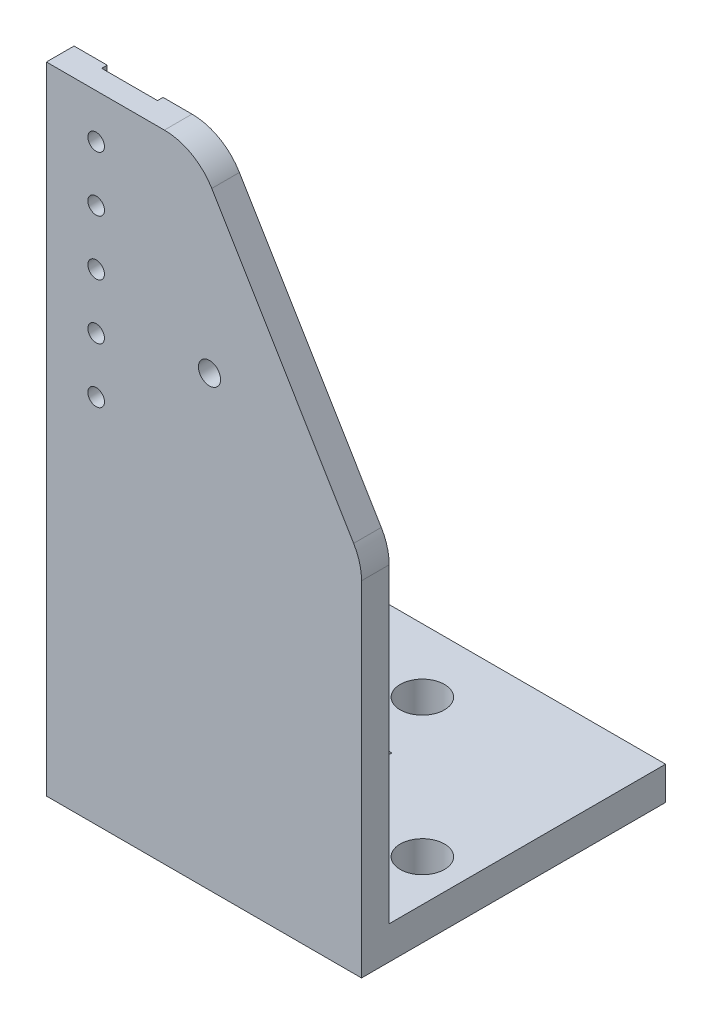
ISO-10303-21;
HEADER;
FILE_DESCRIPTION(('STEP AP214'),'2;1');
FILE_NAME('part.step','',(''),(''),'','','');
FILE_SCHEMA(('AUTOMOTIVE_DESIGN { 1 0 10303 214 1 1 1 1 }'));
ENDSEC;
DATA;
#1=APPLICATION_CONTEXT('core data for automotive mechanical design processes');
#2=APPLICATION_PROTOCOL_DEFINITION('international standard','automotive_design',2000,#1);
#3=PRODUCT_CONTEXT('',#1,'mechanical');
#4=PRODUCT('Part','Part','',(#3));
#5=PRODUCT_RELATED_PRODUCT_CATEGORY('part','',(#4));
#6=PRODUCT_DEFINITION_FORMATION('','',#4);
#7=PRODUCT_DEFINITION_CONTEXT('part definition',#1,'design');
#8=PRODUCT_DEFINITION('design','',#6,#7);
#9=PRODUCT_DEFINITION_SHAPE('','',#8);
#10=(LENGTH_UNIT() NAMED_UNIT(*) SI_UNIT(.MILLI.,.METRE.));
#11=(NAMED_UNIT(*) PLANE_ANGLE_UNIT() SI_UNIT($,.RADIAN.));
#12=(NAMED_UNIT(*) SI_UNIT($,.STERADIAN.) SOLID_ANGLE_UNIT());
#13=UNCERTAINTY_MEASURE_WITH_UNIT(LENGTH_MEASURE(1.E-05),#10,'distance_accuracy_value','');
#14=(GEOMETRIC_REPRESENTATION_CONTEXT(3) GLOBAL_UNCERTAINTY_ASSIGNED_CONTEXT((#13)) GLOBAL_UNIT_ASSIGNED_CONTEXT((#10,
#11,#12)) REPRESENTATION_CONTEXT('',''));
#15=CARTESIAN_POINT('',(0.,0.,0.));
#16=DIRECTION('',(0.,0.,1.));
#17=DIRECTION('',(1.,0.,0.));
#18=AXIS2_PLACEMENT_3D('',#15,#16,#17);
#19=CARTESIAN_POINT('',(0.,115.,25.));
#20=DIRECTION('',(0.,1.,0.));
#21=DIRECTION('',(-1.,0.,0.));
#22=AXIS2_PLACEMENT_3D('',#19,#20,#21);
#23=PLANE('',#22);
#24=DIRECTION('',(1.,0.,0.));
#25=VECTOR('',#24,1.);
#26=CARTESIAN_POINT('',(0.,115.,20.));
#27=LINE('',#26,#25);
#28=CARTESIAN_POINT('',(4.1,115.,20.));
#29=VERTEX_POINT('',#28);
#30=CARTESIAN_POINT('',(9.33809621030929,115.,20.));
#31=VERTEX_POINT('',#30);
#32=EDGE_CURVE('E290',#29,#31,#27,.T.);
#33=ORIENTED_EDGE('',*,*,#32,.F.);
#34=DIRECTION('',(0.,0.,-1.));
#35=VECTOR('',#34,1.);
#36=CARTESIAN_POINT('',(4.1,115.,21.));
#37=LINE('',#36,#35);
#38=CARTESIAN_POINT('',(4.1,115.,21.));
#39=VERTEX_POINT('',#38);
#40=EDGE_CURVE('E222',#39,#29,#37,.T.);
#41=ORIENTED_EDGE('',*,*,#40,.F.);
#42=DIRECTION('',(1.,0.,0.));
#43=VECTOR('',#42,1.);
#44=CARTESIAN_POINT('',(0.,115.,21.));
#45=LINE('',#44,#43);
#46=CARTESIAN_POINT('',(-5.99999999999999,115.,21.));
#47=VERTEX_POINT('',#46);
#48=EDGE_CURVE('E205',#47,#39,#45,.T.);
#49=ORIENTED_EDGE('',*,*,#48,.F.);
#50=DIRECTION('',(0.,0.,-1.));
#51=VECTOR('',#50,1.);
#52=CARTESIAN_POINT('',(-5.99999999999999,115.,21.));
#53=LINE('',#52,#51);
#54=CARTESIAN_POINT('',(-5.99999999999999,115.,20.));
#55=VERTEX_POINT('',#54);
#56=EDGE_CURVE('E225',#47,#55,#53,.T.);
#57=ORIENTED_EDGE('',*,*,#56,.T.);
#58=CARTESIAN_POINT('',(-12.,115.,20.));
#59=VERTEX_POINT('',#58);
#60=EDGE_CURVE('E291',#59,#55,#27,.T.);
#61=ORIENTED_EDGE('',*,*,#60,.F.);
#62=DIRECTION('',(0.,0.,1.));
#63=VECTOR('',#62,1.);
#64=CARTESIAN_POINT('',(-12.,115.,25.));
#65=LINE('',#64,#63);
#66=CARTESIAN_POINT('',(-12.,115.,25.));
#67=VERTEX_POINT('',#66);
#68=EDGE_CURVE('E248',#59,#67,#65,.T.);
#69=ORIENTED_EDGE('',*,*,#68,.T.);
#70=DIRECTION('',(1.,0.,0.));
#71=VECTOR('',#70,1.);
#72=CARTESIAN_POINT('',(0.,115.,25.));
#73=LINE('',#72,#71);
#74=CARTESIAN_POINT('',(9.33809621030929,115.,25.));
#75=VERTEX_POINT('',#74);
#76=EDGE_CURVE('E281',#67,#75,#73,.T.);
#77=ORIENTED_EDGE('',*,*,#76,.T.);
#78=DIRECTION('',(0.,0.,1.));
#79=VECTOR('',#78,1.);
#80=CARTESIAN_POINT('',(9.33809621030929,115.,25.));
#81=LINE('',#80,#79);
#82=EDGE_CURVE('E370',#75,#31,#81,.F.);
#83=ORIENTED_EDGE('',*,*,#82,.T.);
#84=EDGE_LOOP('',(#33,#41,#49,#57,#61,#69,#77,#83));
#85=FACE_BOUND('',#84,.T.);
#86=ADVANCED_FACE('F41',(#85),#23,.T.);
#87=CARTESIAN_POINT('',(0.,0.,20.));
#88=DIRECTION('',(0.,0.,1.));
#89=DIRECTION('',(1.,0.,0.));
#90=AXIS2_PLACEMENT_3D('',#87,#88,#89);
#91=PLANE('',#90);
#92=CARTESIAN_POINT('',(17.5,81.,20.));
#93=DIRECTION('',(0.,0.,1.));
#94=DIRECTION('',(1.,0.,0.));
#95=AXIS2_PLACEMENT_3D('',#92,#93,#94);
#96=CIRCLE('',#95,2.00000000000001);
#97=CARTESIAN_POINT('',(19.5,81.,20.));
#98=VERTEX_POINT('',#97);
#99=EDGE_CURVE('E279',#98,#98,#96,.T.);
#100=ORIENTED_EDGE('',*,*,#99,.T.);
#101=EDGE_LOOP('',(#100));
#102=FACE_BOUND('',#101,.T.);
#103=DIRECTION('',(0.,1.,0.));
#104=VECTOR('',#103,1.);
#105=CARTESIAN_POINT('',(4.1,0.,20.));
#106=LINE('',#105,#104);
#107=CARTESIAN_POINT('',(4.1,60.,20.));
#108=VERTEX_POINT('',#107);
#109=EDGE_CURVE('E56',#108,#29,#106,.T.);
#110=ORIENTED_EDGE('',*,*,#109,.T.);
#111=ORIENTED_EDGE('',*,*,#32,.T.);
#112=CARTESIAN_POINT('',(9.33809621030929,105.,20.));
#113=DIRECTION('',(0.,0.,1.));
#114=DIRECTION('',(1.,0.,0.));
#115=AXIS2_PLACEMENT_3D('',#112,#113,#114);
#116=CIRCLE('',#115,10.);
#117=CARTESIAN_POINT('',(17.9130254674347,110.144957554275,20.));
#118=VERTEX_POINT('',#117);
#119=EDGE_CURVE('E366',#31,#118,#116,.F.);
#120=ORIENTED_EDGE('',*,*,#119,.T.);
#121=DIRECTION('',(-0.514495755427525,0.857492925712545,0.));
#122=VECTOR('',#121,1.);
#123=CARTESIAN_POINT('',(14.9999999999999,115.,20.));
#124=LINE('',#123,#122);
#125=CARTESIAN_POINT('',(43.5749292571255,67.3751179047906,20.));
#126=VERTEX_POINT('',#125);
#127=EDGE_CURVE('E349',#118,#126,#124,.F.);
#128=ORIENTED_EDGE('',*,*,#127,.T.);
#129=CARTESIAN_POINT('',(35.,62.2301603505154,20.));
#130=DIRECTION('',(0.,0.,1.));
#131=DIRECTION('',(1.,0.,0.));
#132=AXIS2_PLACEMENT_3D('',#129,#130,#131);
#133=CIRCLE('',#132,10.);
#134=CARTESIAN_POINT('',(45.,62.2301603505154,20.));
#135=VERTEX_POINT('',#134);
#136=EDGE_CURVE('E368',#126,#135,#133,.F.);
#137=ORIENTED_EDGE('',*,*,#136,.T.);
#138=DIRECTION('',(0.,-1.,0.));
#139=VECTOR('',#138,1.);
#140=CARTESIAN_POINT('',(45.,0.,20.));
#141=LINE('',#140,#139);
#142=CARTESIAN_POINT('',(45.,6.,20.));
#143=VERTEX_POINT('',#142);
#144=EDGE_CURVE('E274',#135,#143,#141,.T.);
#145=ORIENTED_EDGE('',*,*,#144,.T.);
#146=DIRECTION('',(1.,0.,0.));
#147=VECTOR('',#146,1.);
#148=CARTESIAN_POINT('',(0.,6.,20.));
#149=LINE('',#148,#147);
#150=CARTESIAN_POINT('',(-6.99999999999999,6.,20.));
#151=VERTEX_POINT('',#150);
#152=EDGE_CURVE('E337',#151,#143,#149,.T.);
#153=ORIENTED_EDGE('',*,*,#152,.F.);
#154=DIRECTION('',(0.,1.,0.));
#155=VECTOR('',#154,1.);
#156=CARTESIAN_POINT('',(-6.99999999999999,6.,20.));
#157=LINE('',#156,#155);
#158=CARTESIAN_POINT('',(-6.99999999999999,48.3606797749979,20.));
#159=VERTEX_POINT('',#158);
#160=EDGE_CURVE('E64',#151,#159,#157,.T.);
#161=ORIENTED_EDGE('',*,*,#160,.T.);
#162=DIRECTION('',(-1.,0.,0.));
#163=VECTOR('',#162,1.);
#164=CARTESIAN_POINT('',(0.,48.3606797749979,20.));
#165=LINE('',#164,#163);
#166=CARTESIAN_POINT('',(-12.,48.3606797749979,20.));
#167=VERTEX_POINT('',#166);
#168=EDGE_CURVE('E381',#159,#167,#165,.T.);
#169=ORIENTED_EDGE('',*,*,#168,.T.);
#170=DIRECTION('',(0.,-1.,0.));
#171=VECTOR('',#170,1.);
#172=CARTESIAN_POINT('',(-12.,0.,20.));
#173=LINE('',#172,#171);
#174=EDGE_CURVE('E242',#59,#167,#173,.T.);
#175=ORIENTED_EDGE('',*,*,#174,.F.);
#176=ORIENTED_EDGE('',*,*,#60,.T.);
#177=DIRECTION('',(0.,-1.,0.));
#178=VECTOR('',#177,1.);
#179=CARTESIAN_POINT('',(-6.00000000000001,0.,20.));
#180=LINE('',#179,#178);
#181=CARTESIAN_POINT('',(-6.,60.,20.));
#182=VERTEX_POINT('',#181);
#183=EDGE_CURVE('E207',#55,#182,#180,.T.);
#184=ORIENTED_EDGE('',*,*,#183,.T.);
#185=DIRECTION('',(1.,0.,0.));
#186=VECTOR('',#185,1.);
#187=CARTESIAN_POINT('',(0.,60.,20.));
#188=LINE('',#187,#186);
#189=EDGE_CURVE('E210',#182,#108,#188,.T.);
#190=ORIENTED_EDGE('',*,*,#189,.T.);
#191=EDGE_LOOP('',(#110,#111,#120,#128,#137,#145,#153,#161,#169,#175,#176,#184,#190));
#192=FACE_BOUND('',#191,.T.);
#193=ADVANCED_FACE('F426',(#102,#192),#91,.F.);
#194=CARTESIAN_POINT('',(-3.00000000000001,87.,25.));
#195=DIRECTION('',(0.,0.,-1.));
#196=DIRECTION('',(-1.,0.,0.));
#197=AXIS2_PLACEMENT_3D('',#194,#195,#196);
#198=CYLINDRICAL_SURFACE('',#197,1.5);
#199=CARTESIAN_POINT('',(-3.00000000000001,87.,25.));
#200=DIRECTION('',(0.,0.,-1.));
#201=DIRECTION('',(-1.,0.,0.));
#202=AXIS2_PLACEMENT_3D('',#199,#200,#201);
#203=CIRCLE('',#202,1.5);
#204=CARTESIAN_POINT('',(-4.50000000000001,87.,25.));
#205=VERTEX_POINT('',#204);
#206=EDGE_CURVE('E271',#205,#205,#203,.T.);
#207=ORIENTED_EDGE('',*,*,#206,.F.);
#208=EDGE_LOOP('',(#207));
#209=FACE_BOUND('',#208,.T.);
#210=CARTESIAN_POINT('',(-3.00000000000001,87.,21.));
#211=DIRECTION('',(0.,0.,-1.));
#212=DIRECTION('',(-1.,0.,0.));
#213=AXIS2_PLACEMENT_3D('',#210,#211,#212);
#214=CIRCLE('',#213,1.5);
#215=CARTESIAN_POINT('',(-4.50000000000001,87.,21.));
#216=VERTEX_POINT('',#215);
#217=EDGE_CURVE('E200',#216,#216,#214,.F.);
#218=ORIENTED_EDGE('',*,*,#217,.F.);
#219=EDGE_LOOP('',(#218));
#220=FACE_BOUND('',#219,.T.);
#221=ADVANCED_FACE('F466',(#209,#220),#198,.F.);
#222=CARTESIAN_POINT('',(0.,6.,0.));
#223=DIRECTION('',(0.,1.,0.));
#224=DIRECTION('',(0.,0.,1.));
#225=AXIS2_PLACEMENT_3D('',#222,#223,#224);
#226=PLANE('',#225);
#227=DIRECTION('',(0.,0.,1.));
#228=VECTOR('',#227,1.);
#229=CARTESIAN_POINT('',(-12.,6.,0.));
#230=LINE('',#229,#228);
#231=CARTESIAN_POINT('',(-12.,6.,-30.));
#232=VERTEX_POINT('',#231);
#233=CARTESIAN_POINT('',(-12.,6.,-6.18033988749894));
#234=VERTEX_POINT('',#233);
#235=EDGE_CURVE('E239',#232,#234,#230,.T.);
#236=ORIENTED_EDGE('',*,*,#235,.T.);
#237=DIRECTION('',(-1.,0.,0.));
#238=VECTOR('',#237,1.);
#239=CARTESIAN_POINT('',(-7.,6.,-6.18033988749895));
#240=LINE('',#239,#238);
#241=CARTESIAN_POINT('',(-7.,6.,-6.18033988749895));
#242=VERTEX_POINT('',#241);
#243=EDGE_CURVE('E378',#234,#242,#240,.F.);
#244=ORIENTED_EDGE('',*,*,#243,.T.);
#245=DIRECTION('',(0.,0.,1.));
#246=VECTOR('',#245,1.);
#247=CARTESIAN_POINT('',(-6.99999999999999,6.,20.));
#248=LINE('',#247,#246);
#249=EDGE_CURVE('E233',#242,#151,#248,.T.);
#250=ORIENTED_EDGE('',*,*,#249,.T.);
#251=ORIENTED_EDGE('',*,*,#152,.T.);
#252=DIRECTION('',(0.,0.,1.));
#253=VECTOR('',#252,1.);
#254=CARTESIAN_POINT('',(45.,6.,0.));
#255=LINE('',#254,#253);
#256=CARTESIAN_POINT('',(45.,6.,-30.));
#257=VERTEX_POINT('',#256);
#258=EDGE_CURVE('E339',#257,#143,#255,.T.);
#259=ORIENTED_EDGE('',*,*,#258,.F.);
#260=DIRECTION('',(1.,0.,0.));
#261=VECTOR('',#260,1.);
#262=CARTESIAN_POINT('',(-20.,6.,-30.));
#263=LINE('',#262,#261);
#264=EDGE_CURVE('E258',#232,#257,#263,.T.);
#265=ORIENTED_EDGE('',*,*,#264,.F.);
#266=EDGE_LOOP('',(#236,#244,#250,#251,#259,#265));
#267=FACE_BOUND('',#266,.T.);
#268=CARTESIAN_POINT('',(12.5,6.,-18.5));
#269=DIRECTION('',(0.,1.,0.));
#270=DIRECTION('',(0.,0.,1.));
#271=AXIS2_PLACEMENT_3D('',#268,#269,#270);
#272=CIRCLE('',#271,4.);
#273=CARTESIAN_POINT('',(12.5,6.,-14.5));
#274=VERTEX_POINT('',#273);
#275=EDGE_CURVE('E251',#274,#274,#272,.T.);
#276=ORIENTED_EDGE('',*,*,#275,.F.);
#277=EDGE_LOOP('',(#276));
#278=FACE_BOUND('',#277,.T.);
#279=DIRECTION('',(1.,0.,0.));
#280=VECTOR('',#279,1.);
#281=CARTESIAN_POINT('',(0.,6.,19.));
#282=LINE('',#281,#280);
#283=CARTESIAN_POINT('',(3.5,6.,19.));
#284=VERTEX_POINT('',#283);
#285=CARTESIAN_POINT('',(18.5,6.,19.));
#286=VERTEX_POINT('',#285);
#287=EDGE_CURVE('E287',#284,#286,#282,.T.);
#288=ORIENTED_EDGE('',*,*,#287,.F.);
#289=DIRECTION('',(0.,0.,1.));
#290=VECTOR('',#289,1.);
#291=CARTESIAN_POINT('',(3.5,6.,0.));
#292=LINE('',#291,#290);
#293=CARTESIAN_POINT('',(3.5,6.,-6.99999999999998));
#294=VERTEX_POINT('',#293);
#295=EDGE_CURVE('E300',#294,#284,#292,.T.);
#296=ORIENTED_EDGE('',*,*,#295,.F.);
#297=DIRECTION('',(-1.,0.,0.));
#298=VECTOR('',#297,1.);
#299=CARTESIAN_POINT('',(0.,6.,-6.99999999999998));
#300=LINE('',#299,#298);
#301=CARTESIAN_POINT('',(18.5,6.,-6.99999999999998));
#302=VERTEX_POINT('',#301);
#303=EDGE_CURVE('E317',#302,#294,#300,.T.);
#304=ORIENTED_EDGE('',*,*,#303,.F.);
#305=DIRECTION('',(0.,0.,-1.));
#306=VECTOR('',#305,1.);
#307=CARTESIAN_POINT('',(18.5,6.,0.));
#308=LINE('',#307,#306);
#309=EDGE_CURVE('E314',#286,#302,#308,.T.);
#310=ORIENTED_EDGE('',*,*,#309,.F.);
#311=EDGE_LOOP('',(#288,#296,#304,#310));
#312=FACE_BOUND('',#311,.T.);
#313=CARTESIAN_POINT('',(37.5,6.,6.5));
#314=DIRECTION('',(0.,1.,0.));
#315=DIRECTION('',(0.,0.,1.));
#316=AXIS2_PLACEMENT_3D('',#313,#314,#315);
#317=CIRCLE('',#316,4.00000000000001);
#318=CARTESIAN_POINT('',(37.5,6.,10.5));
#319=VERTEX_POINT('',#318);
#320=EDGE_CURVE('E331',#319,#319,#317,.T.);
#321=ORIENTED_EDGE('',*,*,#320,.F.);
#322=EDGE_LOOP('',(#321));
#323=FACE_BOUND('',#322,.T.);
#324=ADVANCED_FACE('F406',(#267,#278,#312,#323),#226,.T.);
#325=CARTESIAN_POINT('',(0.,0.,0.));
#326=DIRECTION('',(0.,1.,0.));
#327=DIRECTION('',(0.,0.,1.));
#328=AXIS2_PLACEMENT_3D('',#325,#326,#327);
#329=PLANE('',#328);
#330=CARTESIAN_POINT('',(37.5,0.,6.5));
#331=DIRECTION('',(0.,1.,0.));
#332=DIRECTION('',(0.,0.,1.));
#333=AXIS2_PLACEMENT_3D('',#330,#331,#332);
#334=CIRCLE('',#333,4.00000000000001);
#335=CARTESIAN_POINT('',(37.5,0.,10.5));
#336=VERTEX_POINT('',#335);
#337=EDGE_CURVE('E324',#336,#336,#334,.T.);
#338=ORIENTED_EDGE('',*,*,#337,.T.);
#339=EDGE_LOOP('',(#338));
#340=FACE_BOUND('',#339,.T.);
#341=CARTESIAN_POINT('',(12.5,0.,6.5));
#342=DIRECTION('',(0.,-1.,0.));
#343=DIRECTION('',(0.,0.,-1.));
#344=AXIS2_PLACEMENT_3D('',#341,#342,#343);
#345=CIRCLE('',#344,6.);
#346=CARTESIAN_POINT('',(12.5,0.,0.500000000000007));
#347=VERTEX_POINT('',#346);
#348=EDGE_CURVE('E264',#347,#347,#345,.T.);
#349=ORIENTED_EDGE('',*,*,#348,.F.);
#350=EDGE_LOOP('',(#349));
#351=FACE_BOUND('',#350,.T.);
#352=CARTESIAN_POINT('',(12.5,0.,-18.5));
#353=DIRECTION('',(0.,1.,0.));
#354=DIRECTION('',(0.,0.,1.));
#355=AXIS2_PLACEMENT_3D('',#352,#353,#354);
#356=CIRCLE('',#355,4.);
#357=CARTESIAN_POINT('',(12.5,0.,-14.5));
#358=VERTEX_POINT('',#357);
#359=EDGE_CURVE('E252',#358,#358,#356,.T.);
#360=ORIENTED_EDGE('',*,*,#359,.T.);
#361=EDGE_LOOP('',(#360));
#362=FACE_BOUND('',#361,.T.);
#363=DIRECTION('',(0.,0.,1.));
#364=VECTOR('',#363,1.);
#365=CARTESIAN_POINT('',(-12.,0.,0.));
#366=LINE('',#365,#364);
#367=CARTESIAN_POINT('',(-12.,0.,-30.));
#368=VERTEX_POINT('',#367);
#369=CARTESIAN_POINT('',(-12.,0.,25.));
#370=VERTEX_POINT('',#369);
#371=EDGE_CURVE('E235',#368,#370,#366,.T.);
#372=ORIENTED_EDGE('',*,*,#371,.F.);
#373=DIRECTION('',(1.,0.,0.));
#374=VECTOR('',#373,1.);
#375=CARTESIAN_POINT('',(-20.,0.,-30.));
#376=LINE('',#375,#374);
#377=CARTESIAN_POINT('',(45.,0.,-30.));
#378=VERTEX_POINT('',#377);
#379=EDGE_CURVE('E255',#368,#378,#376,.T.);
#380=ORIENTED_EDGE('',*,*,#379,.T.);
#381=DIRECTION('',(0.,0.,1.));
#382=VECTOR('',#381,1.);
#383=CARTESIAN_POINT('',(45.,0.,0.));
#384=LINE('',#383,#382);
#385=CARTESIAN_POINT('',(45.,0.,25.));
#386=VERTEX_POINT('',#385);
#387=EDGE_CURVE('E334',#378,#386,#384,.T.);
#388=ORIENTED_EDGE('',*,*,#387,.T.);
#389=DIRECTION('',(1.,0.,0.));
#390=VECTOR('',#389,1.);
#391=CARTESIAN_POINT('',(0.,0.,25.));
#392=LINE('',#391,#390);
#393=EDGE_CURVE('E275',#370,#386,#392,.T.);
#394=ORIENTED_EDGE('',*,*,#393,.F.);
#395=EDGE_LOOP('',(#372,#380,#388,#394));
#396=FACE_BOUND('',#395,.T.);
#397=ADVANCED_FACE('F416',(#340,#351,#362,#396),#329,.F.);
#398=CARTESIAN_POINT('',(0.,0.,25.));
#399=DIRECTION('',(0.,0.,1.));
#400=DIRECTION('',(1.,0.,0.));
#401=AXIS2_PLACEMENT_3D('',#398,#399,#400);
#402=PLANE('',#401);
#403=CARTESIAN_POINT('',(-3.00000000000001,67.,25.));
#404=DIRECTION('',(0.,0.,-1.));
#405=DIRECTION('',(-1.,0.,0.));
#406=AXIS2_PLACEMENT_3D('',#403,#404,#405);
#407=CIRCLE('',#406,1.5);
#408=CARTESIAN_POINT('',(-4.50000000000001,67.,25.));
#409=VERTEX_POINT('',#408);
#410=EDGE_CURVE('E658',#409,#409,#407,.T.);
#411=ORIENTED_EDGE('',*,*,#410,.T.);
#412=EDGE_LOOP('',(#411));
#413=FACE_BOUND('',#412,.T.);
#414=CARTESIAN_POINT('',(-3.00000000000001,97.,25.));
#415=DIRECTION('',(0.,0.,-1.));
#416=DIRECTION('',(-1.,0.,0.));
#417=AXIS2_PLACEMENT_3D('',#414,#415,#416);
#418=CIRCLE('',#417,1.5);
#419=CARTESIAN_POINT('',(-4.50000000000001,97.,25.));
#420=VERTEX_POINT('',#419);
#421=EDGE_CURVE('E668',#420,#420,#418,.T.);
#422=ORIENTED_EDGE('',*,*,#421,.T.);
#423=EDGE_LOOP('',(#422));
#424=FACE_BOUND('',#423,.T.);
#425=CARTESIAN_POINT('',(-3.00000000000001,107.,25.));
#426=DIRECTION('',(0.,0.,-1.));
#427=DIRECTION('',(-1.,0.,0.));
#428=AXIS2_PLACEMENT_3D('',#425,#426,#427);
#429=CIRCLE('',#428,1.5);
#430=CARTESIAN_POINT('',(-4.50000000000001,107.,25.));
#431=VERTEX_POINT('',#430);
#432=EDGE_CURVE('E683',#431,#431,#429,.T.);
#433=ORIENTED_EDGE('',*,*,#432,.T.);
#434=EDGE_LOOP('',(#433));
#435=FACE_BOUND('',#434,.T.);
#436=CARTESIAN_POINT('',(-3.00000000000001,77.,25.));
#437=DIRECTION('',(0.,0.,-1.));
#438=DIRECTION('',(-1.,0.,0.));
#439=AXIS2_PLACEMENT_3D('',#436,#437,#438);
#440=CIRCLE('',#439,1.5);
#441=CARTESIAN_POINT('',(-4.50000000000001,77.,25.));
#442=VERTEX_POINT('',#441);
#443=EDGE_CURVE('E661',#442,#442,#440,.T.);
#444=ORIENTED_EDGE('',*,*,#443,.T.);
#445=EDGE_LOOP('',(#444));
#446=FACE_BOUND('',#445,.T.);
#447=ORIENTED_EDGE('',*,*,#206,.T.);
#448=EDGE_LOOP('',(#447));
#449=FACE_BOUND('',#448,.T.);
#450=CARTESIAN_POINT('',(17.5,81.,25.));
#451=DIRECTION('',(0.,0.,1.));
#452=DIRECTION('',(1.,0.,0.));
#453=AXIS2_PLACEMENT_3D('',#450,#451,#452);
#454=CIRCLE('',#453,2.00000000000001);
#455=CARTESIAN_POINT('',(19.5,81.,25.));
#456=VERTEX_POINT('',#455);
#457=EDGE_CURVE('E284',#456,#456,#454,.T.);
#458=ORIENTED_EDGE('',*,*,#457,.F.);
#459=EDGE_LOOP('',(#458));
#460=FACE_BOUND('',#459,.T.);
#461=DIRECTION('',(0.,-1.,0.));
#462=VECTOR('',#461,1.);
#463=CARTESIAN_POINT('',(45.,0.,25.));
#464=LINE('',#463,#462);
#465=CARTESIAN_POINT('',(45.,62.2301603505154,25.));
#466=VERTEX_POINT('',#465);
#467=EDGE_CURVE('E278',#466,#386,#464,.T.);
#468=ORIENTED_EDGE('',*,*,#467,.F.);
#469=CARTESIAN_POINT('',(35.,62.2301603505154,25.));
#470=DIRECTION('',(0.,0.,1.));
#471=DIRECTION('',(1.,0.,0.));
#472=AXIS2_PLACEMENT_3D('',#469,#470,#471);
#473=CIRCLE('',#472,10.);
#474=CARTESIAN_POINT('',(43.5749292571255,67.3751179047906,25.));
#475=VERTEX_POINT('',#474);
#476=EDGE_CURVE('E360',#466,#475,#473,.T.);
#477=ORIENTED_EDGE('',*,*,#476,.T.);
#478=DIRECTION('',(0.514495755427525,-0.857492925712545,0.));
#479=VECTOR('',#478,1.);
#480=CARTESIAN_POINT('',(61.7647058823528,37.0588235294116,25.));
#481=LINE('',#480,#479);
#482=CARTESIAN_POINT('',(17.9130254674347,110.144957554275,25.));
#483=VERTEX_POINT('',#482);
#484=EDGE_CURVE('E352',#475,#483,#481,.F.);
#485=ORIENTED_EDGE('',*,*,#484,.T.);
#486=CARTESIAN_POINT('',(9.33809621030929,105.,25.));
#487=DIRECTION('',(0.,0.,1.));
#488=DIRECTION('',(1.,0.,0.));
#489=AXIS2_PLACEMENT_3D('',#486,#487,#488);
#490=CIRCLE('',#489,10.);
#491=EDGE_CURVE('E358',#483,#75,#490,.T.);
#492=ORIENTED_EDGE('',*,*,#491,.T.);
#493=ORIENTED_EDGE('',*,*,#76,.F.);
#494=DIRECTION('',(0.,-1.,0.));
#495=VECTOR('',#494,1.);
#496=CARTESIAN_POINT('',(-12.,0.,25.));
#497=LINE('',#496,#495);
#498=EDGE_CURVE('E245',#67,#370,#497,.T.);
#499=ORIENTED_EDGE('',*,*,#498,.T.);
#500=ORIENTED_EDGE('',*,*,#393,.T.);
#501=EDGE_LOOP('',(#468,#477,#485,#492,#493,#499,#500));
#502=FACE_BOUND('',#501,.T.);
#503=ADVANCED_FACE('F420',(#413,#424,#435,#446,#449,#460,#502),#402,.T.);
#504=CARTESIAN_POINT('',(-20.,6.,-30.));
#505=DIRECTION('',(0.,0.,-1.));
#506=DIRECTION('',(-1.,0.,0.));
#507=AXIS2_PLACEMENT_3D('',#504,#505,#506);
#508=PLANE('',#507);
#509=ORIENTED_EDGE('',*,*,#379,.F.);
#510=DIRECTION('',(0.,1.,0.));
#511=VECTOR('',#510,1.);
#512=CARTESIAN_POINT('',(-12.,6.,-30.));
#513=LINE('',#512,#511);
#514=EDGE_CURVE('E342',#368,#232,#513,.T.);
#515=ORIENTED_EDGE('',*,*,#514,.T.);
#516=ORIENTED_EDGE('',*,*,#264,.T.);
#517=DIRECTION('',(0.,-1.,0.));
#518=VECTOR('',#517,1.);
#519=CARTESIAN_POINT('',(45.,6.,-30.));
#520=LINE('',#519,#518);
#521=EDGE_CURVE('E260',#257,#378,#520,.T.);
#522=ORIENTED_EDGE('',*,*,#521,.T.);
#523=EDGE_LOOP('',(#509,#515,#516,#522));
#524=FACE_BOUND('',#523,.T.);
#525=ADVANCED_FACE('F412',(#524),#508,.T.);
#526=CARTESIAN_POINT('',(12.5,0.,6.5));
#527=DIRECTION('',(0.,1.,0.));
#528=DIRECTION('',(0.,0.,1.));
#529=AXIS2_PLACEMENT_3D('',#526,#527,#528);
#530=CYLINDRICAL_SURFACE('',#529,3.);
#531=CARTESIAN_POINT('',(12.5,5.,6.5));
#532=DIRECTION('',(0.,1.,0.));
#533=DIRECTION('',(0.,0.,1.));
#534=AXIS2_PLACEMENT_3D('',#531,#532,#533);
#535=CIRCLE('',#534,3.);
#536=CARTESIAN_POINT('',(12.5,5.,9.5));
#537=VERTEX_POINT('',#536);
#538=EDGE_CURVE('E309',#537,#537,#535,.F.);
#539=ORIENTED_EDGE('',*,*,#538,.F.);
#540=EDGE_LOOP('',(#539));
#541=FACE_BOUND('',#540,.T.);
#542=CARTESIAN_POINT('',(12.5,2.,6.5));
#543=DIRECTION('',(0.,-1.,0.));
#544=DIRECTION('',(0.,0.,-1.));
#545=AXIS2_PLACEMENT_3D('',#542,#543,#544);
#546=CIRCLE('',#545,3.);
#547=CARTESIAN_POINT('',(12.5,2.,3.5));
#548=VERTEX_POINT('',#547);
#549=EDGE_CURVE('E268',#548,#548,#546,.F.);
#550=ORIENTED_EDGE('',*,*,#549,.F.);
#551=EDGE_LOOP('',(#550));
#552=FACE_BOUND('',#551,.T.);
#553=ADVANCED_FACE('F448',(#541,#552),#530,.F.);
#554=CARTESIAN_POINT('',(45.,6.,0.));
#555=DIRECTION('',(1.,0.,0.));
#556=DIRECTION('',(0.,0.,-1.));
#557=AXIS2_PLACEMENT_3D('',#554,#555,#556);
#558=PLANE('',#557);
#559=ORIENTED_EDGE('',*,*,#144,.F.);
#560=DIRECTION('',(0.,0.,-1.));
#561=VECTOR('',#560,1.);
#562=CARTESIAN_POINT('',(45.,62.2301603505154,0.));
#563=LINE('',#562,#561);
#564=EDGE_CURVE('E355',#135,#466,#563,.F.);
#565=ORIENTED_EDGE('',*,*,#564,.T.);
#566=ORIENTED_EDGE('',*,*,#467,.T.);
#567=ORIENTED_EDGE('',*,*,#387,.F.);
#568=ORIENTED_EDGE('',*,*,#521,.F.);
#569=ORIENTED_EDGE('',*,*,#258,.T.);
#570=EDGE_LOOP('',(#559,#565,#566,#567,#568,#569));
#571=FACE_BOUND('',#570,.T.);
#572=ADVANCED_FACE('F445',(#571),#558,.T.);
#573=CARTESIAN_POINT('',(37.5,0.,6.5));
#574=DIRECTION('',(0.,1.,0.));
#575=DIRECTION('',(0.,0.,1.));
#576=AXIS2_PLACEMENT_3D('',#573,#574,#575);
#577=CYLINDRICAL_SURFACE('',#576,4.00000000000001);
#578=ORIENTED_EDGE('',*,*,#337,.F.);
#579=EDGE_LOOP('',(#578));
#580=FACE_BOUND('',#579,.T.);
#581=ORIENTED_EDGE('',*,*,#320,.T.);
#582=EDGE_LOOP('',(#581));
#583=FACE_BOUND('',#582,.T.);
#584=ADVANCED_FACE('F447',(#580,#583),#577,.F.);
#585=CARTESIAN_POINT('',(0.,5.,19.));
#586=DIRECTION('',(0.,0.,1.));
#587=DIRECTION('',(1.,0.,0.));
#588=AXIS2_PLACEMENT_3D('',#585,#586,#587);
#589=PLANE('',#588);
#590=ORIENTED_EDGE('',*,*,#287,.T.);
#591=DIRECTION('',(0.,1.,0.));
#592=VECTOR('',#591,1.);
#593=CARTESIAN_POINT('',(18.5,5.,19.));
#594=LINE('',#593,#592);
#595=CARTESIAN_POINT('',(18.5,5.,19.));
#596=VERTEX_POINT('',#595);
#597=EDGE_CURVE('E312',#596,#286,#594,.T.);
#598=ORIENTED_EDGE('',*,*,#597,.F.);
#599=DIRECTION('',(1.,0.,0.));
#600=VECTOR('',#599,1.);
#601=CARTESIAN_POINT('',(0.,5.,19.));
#602=LINE('',#601,#600);
#603=CARTESIAN_POINT('',(3.5,5.,19.));
#604=VERTEX_POINT('',#603);
#605=EDGE_CURVE('E296',#604,#596,#602,.T.);
#606=ORIENTED_EDGE('',*,*,#605,.F.);
#607=DIRECTION('',(0.,1.,0.));
#608=VECTOR('',#607,1.);
#609=CARTESIAN_POINT('',(3.5,5.,19.));
#610=LINE('',#609,#608);
#611=EDGE_CURVE('E322',#604,#284,#610,.T.);
#612=ORIENTED_EDGE('',*,*,#611,.T.);
#613=EDGE_LOOP('',(#590,#598,#606,#612));
#614=FACE_BOUND('',#613,.T.);
#615=ADVANCED_FACE('F454',(#614),#589,.F.);
#616=CARTESIAN_POINT('',(3.5,5.,0.));
#617=DIRECTION('',(-1.,0.,0.));
#618=DIRECTION('',(0.,0.,1.));
#619=AXIS2_PLACEMENT_3D('',#616,#617,#618);
#620=PLANE('',#619);
#621=ORIENTED_EDGE('',*,*,#295,.T.);
#622=ORIENTED_EDGE('',*,*,#611,.F.);
#623=DIRECTION('',(0.,0.,1.));
#624=VECTOR('',#623,1.);
#625=CARTESIAN_POINT('',(3.5,5.,0.));
#626=LINE('',#625,#624);
#627=CARTESIAN_POINT('',(3.5,5.,-6.99999999999998));
#628=VERTEX_POINT('',#627);
#629=EDGE_CURVE('E306',#628,#604,#626,.T.);
#630=ORIENTED_EDGE('',*,*,#629,.F.);
#631=DIRECTION('',(0.,1.,0.));
#632=VECTOR('',#631,1.);
#633=CARTESIAN_POINT('',(3.5,5.,-6.99999999999998));
#634=LINE('',#633,#632);
#635=EDGE_CURVE('E325',#628,#294,#634,.T.);
#636=ORIENTED_EDGE('',*,*,#635,.T.);
#637=EDGE_LOOP('',(#621,#622,#630,#636));
#638=FACE_BOUND('',#637,.T.);
#639=ADVANCED_FACE('F477',(#638),#620,.F.);
#640=CARTESIAN_POINT('',(0.,5.,-6.99999999999998));
#641=DIRECTION('',(0.,0.,-1.));
#642=DIRECTION('',(-1.,0.,0.));
#643=AXIS2_PLACEMENT_3D('',#640,#641,#642);
#644=PLANE('',#643);
#645=ORIENTED_EDGE('',*,*,#303,.T.);
#646=ORIENTED_EDGE('',*,*,#635,.F.);
#647=DIRECTION('',(-1.,0.,0.));
#648=VECTOR('',#647,1.);
#649=CARTESIAN_POINT('',(0.,5.,-6.99999999999998));
#650=LINE('',#649,#648);
#651=CARTESIAN_POINT('',(18.5,5.,-6.99999999999998));
#652=VERTEX_POINT('',#651);
#653=EDGE_CURVE('E303',#652,#628,#650,.T.);
#654=ORIENTED_EDGE('',*,*,#653,.F.);
#655=DIRECTION('',(0.,1.,0.));
#656=VECTOR('',#655,1.);
#657=CARTESIAN_POINT('',(18.5,5.,-6.99999999999998));
#658=LINE('',#657,#656);
#659=EDGE_CURVE('E327',#652,#302,#658,.T.);
#660=ORIENTED_EDGE('',*,*,#659,.T.);
#661=EDGE_LOOP('',(#645,#646,#654,#660));
#662=FACE_BOUND('',#661,.T.);
#663=ADVANCED_FACE('F480',(#662),#644,.F.);
#664=CARTESIAN_POINT('',(18.5,5.,0.));
#665=DIRECTION('',(1.,0.,0.));
#666=DIRECTION('',(0.,0.,-1.));
#667=AXIS2_PLACEMENT_3D('',#664,#665,#666);
#668=PLANE('',#667);
#669=ORIENTED_EDGE('',*,*,#309,.T.);
#670=ORIENTED_EDGE('',*,*,#659,.F.);
#671=DIRECTION('',(0.,0.,-1.));
#672=VECTOR('',#671,1.);
#673=CARTESIAN_POINT('',(18.5,5.,0.));
#674=LINE('',#673,#672);
#675=EDGE_CURVE('E299',#596,#652,#674,.T.);
#676=ORIENTED_EDGE('',*,*,#675,.F.);
#677=ORIENTED_EDGE('',*,*,#597,.T.);
#678=EDGE_LOOP('',(#669,#670,#676,#677));
#679=FACE_BOUND('',#678,.T.);
#680=ADVANCED_FACE('F475',(#679),#668,.F.);
#681=CARTESIAN_POINT('',(0.,5.,0.));
#682=DIRECTION('',(0.,1.,0.));
#683=DIRECTION('',(0.,0.,1.));
#684=AXIS2_PLACEMENT_3D('',#681,#682,#683);
#685=PLANE('',#684);
#686=ORIENTED_EDGE('',*,*,#605,.T.);
#687=ORIENTED_EDGE('',*,*,#675,.T.);
#688=ORIENTED_EDGE('',*,*,#653,.T.);
#689=ORIENTED_EDGE('',*,*,#629,.T.);
#690=EDGE_LOOP('',(#686,#687,#688,#689));
#691=FACE_BOUND('',#690,.T.);
#692=ORIENTED_EDGE('',*,*,#538,.T.);
#693=EDGE_LOOP('',(#692));
#694=FACE_BOUND('',#693,.T.);
#695=ADVANCED_FACE('F472',(#691,#694),#685,.T.);
#696=CARTESIAN_POINT('',(17.5,81.,25.));
#697=DIRECTION('',(0.,0.,-1.));
#698=DIRECTION('',(-1.,0.,0.));
#699=AXIS2_PLACEMENT_3D('',#696,#697,#698);
#700=CYLINDRICAL_SURFACE('',#699,2.00000000000001);
#701=ORIENTED_EDGE('',*,*,#457,.T.);
#702=EDGE_LOOP('',(#701));
#703=FACE_BOUND('',#702,.T.);
#704=ORIENTED_EDGE('',*,*,#99,.F.);
#705=EDGE_LOOP('',(#704));
#706=FACE_BOUND('',#705,.T.);
#707=ADVANCED_FACE('F471',(#703,#706),#700,.F.);
#708=CARTESIAN_POINT('',(12.5,2.,6.5));
#709=DIRECTION('',(0.,-1.,0.));
#710=DIRECTION('',(0.,0.,-1.));
#711=AXIS2_PLACEMENT_3D('',#708,#709,#710);
#712=PLANE('',#711);
#713=CARTESIAN_POINT('',(12.5,2.,6.5));
#714=DIRECTION('',(0.,-1.,0.));
#715=DIRECTION('',(0.,0.,-1.));
#716=AXIS2_PLACEMENT_3D('',#713,#714,#715);
#717=CIRCLE('',#716,6.);
#718=CARTESIAN_POINT('',(12.5,2.,0.500000000000007));
#719=VERTEX_POINT('',#718);
#720=EDGE_CURVE('E265',#719,#719,#717,.T.);
#721=ORIENTED_EDGE('',*,*,#720,.T.);
#722=EDGE_LOOP('',(#721));
#723=FACE_BOUND('',#722,.T.);
#724=ORIENTED_EDGE('',*,*,#549,.T.);
#725=EDGE_LOOP('',(#724));
#726=FACE_BOUND('',#725,.T.);
#727=ADVANCED_FACE('F528',(#723,#726),#712,.T.);
#728=CARTESIAN_POINT('',(12.5,2.,6.5));
#729=DIRECTION('',(0.,-1.,0.));
#730=DIRECTION('',(0.,0.,-1.));
#731=AXIS2_PLACEMENT_3D('',#728,#729,#730);
#732=CYLINDRICAL_SURFACE('',#731,6.);
#733=ORIENTED_EDGE('',*,*,#720,.F.);
#734=EDGE_LOOP('',(#733));
#735=FACE_BOUND('',#734,.T.);
#736=ORIENTED_EDGE('',*,*,#348,.T.);
#737=EDGE_LOOP('',(#736));
#738=FACE_BOUND('',#737,.T.);
#739=ADVANCED_FACE('F508',(#735,#738),#732,.F.);
#740=CARTESIAN_POINT('',(12.5,0.,-18.5));
#741=DIRECTION('',(0.,1.,0.));
#742=DIRECTION('',(0.,0.,1.));
#743=AXIS2_PLACEMENT_3D('',#740,#741,#742);
#744=CYLINDRICAL_SURFACE('',#743,4.);
#745=ORIENTED_EDGE('',*,*,#359,.F.);
#746=EDGE_LOOP('',(#745));
#747=FACE_BOUND('',#746,.T.);
#748=ORIENTED_EDGE('',*,*,#275,.T.);
#749=EDGE_LOOP('',(#748));
#750=FACE_BOUND('',#749,.T.);
#751=ADVANCED_FACE('F505',(#747,#750),#744,.F.);
#752=CARTESIAN_POINT('',(-12.,0.,0.));
#753=DIRECTION('',(-1.,0.,0.));
#754=DIRECTION('',(0.,0.,1.));
#755=AXIS2_PLACEMENT_3D('',#752,#753,#754);
#756=PLANE('',#755);
#757=ORIENTED_EDGE('',*,*,#174,.T.);
#758=CARTESIAN_POINT('',(-12.,48.3606797749979,10.));
#759=DIRECTION('',(-1.,0.,0.));
#760=DIRECTION('',(0.,0.,1.));
#761=AXIS2_PLACEMENT_3D('',#758,#759,#760);
#762=CIRCLE('',#761,10.);
#763=CARTESIAN_POINT('',(-12.,43.8885438199983,18.9442719099992));
#764=VERTEX_POINT('',#763);
#765=EDGE_CURVE('E49',#167,#764,#762,.F.);
#766=ORIENTED_EDGE('',*,*,#765,.T.);
#767=DIRECTION('',(0.,-0.894427190999916,-0.447213595499958));
#768=VECTOR('',#767,1.);
#769=CARTESIAN_POINT('',(-12.,46.,20.));
#770=LINE('',#769,#768);
#771=CARTESIAN_POINT('',(-12.,11.5278640450004,2.76393202250021));
#772=VERTEX_POINT('',#771);
#773=EDGE_CURVE('E224',#764,#772,#770,.T.);
#774=ORIENTED_EDGE('',*,*,#773,.T.);
#775=CARTESIAN_POINT('',(-12.,16.,-6.18033988749894));
#776=DIRECTION('',(-1.,0.,0.));
#777=DIRECTION('',(0.,0.,1.));
#778=AXIS2_PLACEMENT_3D('',#775,#776,#777);
#779=CIRCLE('',#778,10.);
#780=EDGE_CURVE('E383',#772,#234,#779,.F.);
#781=ORIENTED_EDGE('',*,*,#780,.T.);
#782=ORIENTED_EDGE('',*,*,#235,.F.);
#783=ORIENTED_EDGE('',*,*,#514,.F.);
#784=ORIENTED_EDGE('',*,*,#371,.T.);
#785=ORIENTED_EDGE('',*,*,#498,.F.);
#786=ORIENTED_EDGE('',*,*,#68,.F.);
#787=EDGE_LOOP('',(#757,#766,#774,#781,#782,#783,#784,#785,#786));
#788=FACE_BOUND('',#787,.T.);
#789=ADVANCED_FACE('F388',(#788),#756,.T.);
#790=CARTESIAN_POINT('',(14.9999999999999,115.,25.));
#791=DIRECTION('',(-0.857492925712545,-0.514495755427525,0.));
#792=DIRECTION('',(0.,0.,-1.));
#793=AXIS2_PLACEMENT_3D('',#790,#791,#792);
#794=PLANE('',#793);
#795=ORIENTED_EDGE('',*,*,#484,.F.);
#796=DIRECTION('',(0.,0.,1.));
#797=VECTOR('',#796,1.);
#798=CARTESIAN_POINT('',(43.5749292571255,67.3751179047906,25.));
#799=LINE('',#798,#797);
#800=EDGE_CURVE('E364',#475,#126,#799,.F.);
#801=ORIENTED_EDGE('',*,*,#800,.T.);
#802=ORIENTED_EDGE('',*,*,#127,.F.);
#803=DIRECTION('',(0.,0.,-1.));
#804=VECTOR('',#803,1.);
#805=CARTESIAN_POINT('',(17.9130254674347,110.144957554275,25.));
#806=LINE('',#805,#804);
#807=EDGE_CURVE('E362',#118,#483,#806,.F.);
#808=ORIENTED_EDGE('',*,*,#807,.T.);
#809=EDGE_LOOP('',(#795,#801,#802,#808));
#810=FACE_BOUND('',#809,.T.);
#811=ADVANCED_FACE('F437',(#810),#794,.F.);
#812=CARTESIAN_POINT('',(35.,62.2301603505154,0.));
#813=DIRECTION('',(0.,0.,-1.));
#814=DIRECTION('',(-1.,0.,0.));
#815=AXIS2_PLACEMENT_3D('',#812,#813,#814);
#816=CYLINDRICAL_SURFACE('',#815,10.);
#817=ORIENTED_EDGE('',*,*,#136,.F.);
#818=ORIENTED_EDGE('',*,*,#800,.F.);
#819=ORIENTED_EDGE('',*,*,#476,.F.);
#820=ORIENTED_EDGE('',*,*,#564,.F.);
#821=EDGE_LOOP('',(#817,#818,#819,#820));
#822=FACE_BOUND('',#821,.T.);
#823=ADVANCED_FACE('F442',(#822),#816,.T.);
#824=CARTESIAN_POINT('',(9.33809621030929,105.,25.));
#825=DIRECTION('',(0.,0.,1.));
#826=DIRECTION('',(1.,0.,0.));
#827=AXIS2_PLACEMENT_3D('',#824,#825,#826);
#828=CYLINDRICAL_SURFACE('',#827,10.);
#829=ORIENTED_EDGE('',*,*,#491,.F.);
#830=ORIENTED_EDGE('',*,*,#807,.F.);
#831=ORIENTED_EDGE('',*,*,#119,.F.);
#832=ORIENTED_EDGE('',*,*,#82,.F.);
#833=EDGE_LOOP('',(#829,#830,#831,#832));
#834=FACE_BOUND('',#833,.T.);
#835=ADVANCED_FACE('F434',(#834),#828,.T.);
#836=CARTESIAN_POINT('',(-6.99999999999999,46.,20.));
#837=DIRECTION('',(0.,0.447213595499958,-0.894427190999916));
#838=DIRECTION('',(0.,0.894427190999916,0.447213595499958));
#839=AXIS2_PLACEMENT_3D('',#836,#837,#838);
#840=PLANE('',#839);
#841=DIRECTION('',(0.,-0.894427190999916,-0.447213595499958));
#842=VECTOR('',#841,1.);
#843=CARTESIAN_POINT('',(-6.99999999999999,46.,20.));
#844=LINE('',#843,#842);
#845=CARTESIAN_POINT('',(-6.99999999999999,43.8885438199983,18.9442719099992));
#846=VERTEX_POINT('',#845);
#847=CARTESIAN_POINT('',(-7.,11.5278640450004,2.76393202250021));
#848=VERTEX_POINT('',#847);
#849=EDGE_CURVE('E230',#846,#848,#844,.T.);
#850=ORIENTED_EDGE('',*,*,#849,.T.);
#851=DIRECTION('',(-1.,0.,0.));
#852=VECTOR('',#851,1.);
#853=CARTESIAN_POINT('',(-12.,11.5278640450004,2.76393202250022));
#854=LINE('',#853,#852);
#855=EDGE_CURVE('E375',#848,#772,#854,.T.);
#856=ORIENTED_EDGE('',*,*,#855,.T.);
#857=ORIENTED_EDGE('',*,*,#773,.F.);
#858=DIRECTION('',(-1.,0.,0.));
#859=VECTOR('',#858,1.);
#860=CARTESIAN_POINT('',(-6.99999999999999,43.8885438199983,18.9442719099992));
#861=LINE('',#860,#859);
#862=EDGE_CURVE('E373',#764,#846,#861,.F.);
#863=ORIENTED_EDGE('',*,*,#862,.T.);
#864=EDGE_LOOP('',(#850,#856,#857,#863));
#865=FACE_BOUND('',#864,.T.);
#866=ADVANCED_FACE('F394',(#865),#840,.T.);
#867=CARTESIAN_POINT('',(-7.,0.,0.));
#868=DIRECTION('',(-1.,0.,0.));
#869=DIRECTION('',(0.,0.,1.));
#870=AXIS2_PLACEMENT_3D('',#867,#868,#869);
#871=PLANE('',#870);
#872=ORIENTED_EDGE('',*,*,#160,.F.);
#873=ORIENTED_EDGE('',*,*,#249,.F.);
#874=CARTESIAN_POINT('',(-7.,16.,-6.18033988749895));
#875=DIRECTION('',(-1.,0.,0.));
#876=DIRECTION('',(0.,0.,1.));
#877=AXIS2_PLACEMENT_3D('',#874,#875,#876);
#878=CIRCLE('',#877,10.);
#879=EDGE_CURVE('E385',#242,#848,#878,.T.);
#880=ORIENTED_EDGE('',*,*,#879,.T.);
#881=ORIENTED_EDGE('',*,*,#849,.F.);
#882=CARTESIAN_POINT('',(-6.99999999999999,48.3606797749979,10.));
#883=DIRECTION('',(-1.,0.,0.));
#884=DIRECTION('',(0.,0.,1.));
#885=AXIS2_PLACEMENT_3D('',#882,#883,#884);
#886=CIRCLE('',#885,10.);
#887=EDGE_CURVE('E12',#846,#159,#886,.T.);
#888=ORIENTED_EDGE('',*,*,#887,.T.);
#889=EDGE_LOOP('',(#872,#873,#880,#881,#888));
#890=FACE_BOUND('',#889,.T.);
#891=ADVANCED_FACE('F399',(#890),#871,.F.);
#892=CARTESIAN_POINT('',(-7.,16.,-6.18033988749895));
#893=DIRECTION('',(1.,0.,0.));
#894=DIRECTION('',(0.,0.,-1.));
#895=AXIS2_PLACEMENT_3D('',#892,#893,#894);
#896=CYLINDRICAL_SURFACE('',#895,10.);
#897=ORIENTED_EDGE('',*,*,#879,.F.);
#898=ORIENTED_EDGE('',*,*,#243,.F.);
#899=ORIENTED_EDGE('',*,*,#780,.F.);
#900=ORIENTED_EDGE('',*,*,#855,.F.);
#901=EDGE_LOOP('',(#897,#898,#899,#900));
#902=FACE_BOUND('',#901,.T.);
#903=ADVANCED_FACE('F402',(#902),#896,.F.);
#904=CARTESIAN_POINT('',(0.,48.3606797749979,10.));
#905=DIRECTION('',(-1.,0.,0.));
#906=DIRECTION('',(0.,-1.,0.));
#907=AXIS2_PLACEMENT_3D('',#904,#905,#906);
#908=CYLINDRICAL_SURFACE('',#907,10.);
#909=ORIENTED_EDGE('',*,*,#887,.F.);
#910=ORIENTED_EDGE('',*,*,#862,.F.);
#911=ORIENTED_EDGE('',*,*,#765,.F.);
#912=ORIENTED_EDGE('',*,*,#168,.F.);
#913=EDGE_LOOP('',(#909,#910,#911,#912));
#914=FACE_BOUND('',#913,.T.);
#915=ADVANCED_FACE('F43',(#914),#908,.F.);
#916=CARTESIAN_POINT('',(4.1,0.,21.));
#917=DIRECTION('',(-1.,0.,0.));
#918=DIRECTION('',(0.,0.,1.));
#919=AXIS2_PLACEMENT_3D('',#916,#917,#918);
#920=PLANE('',#919);
#921=ORIENTED_EDGE('',*,*,#109,.F.);
#922=DIRECTION('',(0.,0.,-1.));
#923=VECTOR('',#922,1.);
#924=CARTESIAN_POINT('',(4.1,60.,21.));
#925=LINE('',#924,#923);
#926=CARTESIAN_POINT('',(4.1,60.,21.));
#927=VERTEX_POINT('',#926);
#928=EDGE_CURVE('E189',#927,#108,#925,.T.);
#929=ORIENTED_EDGE('',*,*,#928,.F.);
#930=DIRECTION('',(0.,1.,0.));
#931=VECTOR('',#930,1.);
#932=CARTESIAN_POINT('',(4.1,0.,21.));
#933=LINE('',#932,#931);
#934=EDGE_CURVE('E196',#927,#39,#933,.T.);
#935=ORIENTED_EDGE('',*,*,#934,.T.);
#936=ORIENTED_EDGE('',*,*,#40,.T.);
#937=EDGE_LOOP('',(#921,#929,#935,#936));
#938=FACE_BOUND('',#937,.T.);
#939=ADVANCED_FACE('F198',(#938),#920,.T.);
#940=CARTESIAN_POINT('',(-6.00000000000001,0.,21.));
#941=DIRECTION('',(1.,0.,0.));
#942=DIRECTION('',(0.,1.,0.));
#943=AXIS2_PLACEMENT_3D('',#940,#941,#942);
#944=PLANE('',#943);
#945=ORIENTED_EDGE('',*,*,#183,.F.);
#946=ORIENTED_EDGE('',*,*,#56,.F.);
#947=DIRECTION('',(0.,-1.,0.));
#948=VECTOR('',#947,1.);
#949=CARTESIAN_POINT('',(-6.00000000000001,0.,21.));
#950=LINE('',#949,#948);
#951=CARTESIAN_POINT('',(-6.,60.,21.));
#952=VERTEX_POINT('',#951);
#953=EDGE_CURVE('E195',#47,#952,#950,.T.);
#954=ORIENTED_EDGE('',*,*,#953,.T.);
#955=DIRECTION('',(0.,0.,-1.));
#956=VECTOR('',#955,1.);
#957=CARTESIAN_POINT('',(-6.,60.,21.));
#958=LINE('',#957,#956);
#959=EDGE_CURVE('E191',#952,#182,#958,.T.);
#960=ORIENTED_EDGE('',*,*,#959,.T.);
#961=EDGE_LOOP('',(#945,#946,#954,#960));
#962=FACE_BOUND('',#961,.T.);
#963=ADVANCED_FACE('F428',(#962),#944,.T.);
#964=CARTESIAN_POINT('',(0.,60.,21.));
#965=DIRECTION('',(0.,1.,0.));
#966=DIRECTION('',(0.,0.,1.));
#967=AXIS2_PLACEMENT_3D('',#964,#965,#966);
#968=PLANE('',#967);
#969=ORIENTED_EDGE('',*,*,#189,.F.);
#970=ORIENTED_EDGE('',*,*,#959,.F.);
#971=DIRECTION('',(1.,0.,0.));
#972=VECTOR('',#971,1.);
#973=CARTESIAN_POINT('',(0.,60.,21.));
#974=LINE('',#973,#972);
#975=EDGE_CURVE('E186',#952,#927,#974,.T.);
#976=ORIENTED_EDGE('',*,*,#975,.T.);
#977=ORIENTED_EDGE('',*,*,#928,.T.);
#978=EDGE_LOOP('',(#969,#970,#976,#977));
#979=FACE_BOUND('',#978,.T.);
#980=ADVANCED_FACE('F188',(#979),#968,.T.);
#981=CARTESIAN_POINT('',(0.,0.,21.));
#982=DIRECTION('',(0.,0.,-1.));
#983=DIRECTION('',(-1.,0.,0.));
#984=AXIS2_PLACEMENT_3D('',#981,#982,#983);
#985=PLANE('',#984);
#986=CARTESIAN_POINT('',(-3.00000000000001,67.,21.));
#987=DIRECTION('',(0.,0.,-1.));
#988=DIRECTION('',(-1.,0.,0.));
#989=AXIS2_PLACEMENT_3D('',#986,#987,#988);
#990=CIRCLE('',#989,1.5);
#991=CARTESIAN_POINT('',(-4.50000000000001,67.,21.));
#992=VERTEX_POINT('',#991);
#993=EDGE_CURVE('E660',#992,#992,#990,.F.);
#994=ORIENTED_EDGE('',*,*,#993,.T.);
#995=EDGE_LOOP('',(#994));
#996=FACE_BOUND('',#995,.T.);
#997=CARTESIAN_POINT('',(-3.00000000000001,97.,21.));
#998=DIRECTION('',(0.,0.,-1.));
#999=DIRECTION('',(-1.,0.,0.));
#1000=AXIS2_PLACEMENT_3D('',#997,#998,#999);
#1001=CIRCLE('',#1000,1.5);
#1002=CARTESIAN_POINT('',(-4.50000000000001,97.,21.));
#1003=VERTEX_POINT('',#1002);
#1004=EDGE_CURVE('E664',#1003,#1003,#1001,.F.);
#1005=ORIENTED_EDGE('',*,*,#1004,.T.);
#1006=EDGE_LOOP('',(#1005));
#1007=FACE_BOUND('',#1006,.T.);
#1008=CARTESIAN_POINT('',(-3.00000000000001,107.,21.));
#1009=DIRECTION('',(0.,0.,-1.));
#1010=DIRECTION('',(-1.,0.,0.));
#1011=AXIS2_PLACEMENT_3D('',#1008,#1009,#1010);
#1012=CIRCLE('',#1011,1.5);
#1013=CARTESIAN_POINT('',(-4.50000000000001,107.,21.));
#1014=VERTEX_POINT('',#1013);
#1015=EDGE_CURVE('E671',#1014,#1014,#1012,.F.);
#1016=ORIENTED_EDGE('',*,*,#1015,.T.);
#1017=EDGE_LOOP('',(#1016));
#1018=FACE_BOUND('',#1017,.T.);
#1019=CARTESIAN_POINT('',(-3.00000000000001,77.,21.));
#1020=DIRECTION('',(0.,0.,-1.));
#1021=DIRECTION('',(-1.,0.,0.));
#1022=AXIS2_PLACEMENT_3D('',#1019,#1020,#1021);
#1023=CIRCLE('',#1022,1.5);
#1024=CARTESIAN_POINT('',(-4.50000000000001,77.,21.));
#1025=VERTEX_POINT('',#1024);
#1026=EDGE_CURVE('E213',#1025,#1025,#1023,.F.);
#1027=ORIENTED_EDGE('',*,*,#1026,.T.);
#1028=EDGE_LOOP('',(#1027));
#1029=FACE_BOUND('',#1028,.T.);
#1030=ORIENTED_EDGE('',*,*,#934,.F.);
#1031=ORIENTED_EDGE('',*,*,#975,.F.);
#1032=ORIENTED_EDGE('',*,*,#953,.F.);
#1033=ORIENTED_EDGE('',*,*,#48,.T.);
#1034=EDGE_LOOP('',(#1030,#1031,#1032,#1033));
#1035=FACE_BOUND('',#1034,.T.);
#1036=ORIENTED_EDGE('',*,*,#217,.T.);
#1037=EDGE_LOOP('',(#1036));
#1038=FACE_BOUND('',#1037,.T.);
#1039=ADVANCED_FACE('F202',(#996,#1007,#1018,#1029,#1035,#1038),#985,.T.);
#1040=CARTESIAN_POINT('',(-3.00000000000001,77.,25.));
#1041=DIRECTION('',(0.,0.,-1.));
#1042=DIRECTION('',(-1.,0.,0.));
#1043=AXIS2_PLACEMENT_3D('',#1040,#1041,#1042);
#1044=CYLINDRICAL_SURFACE('',#1043,1.5);
#1045=ORIENTED_EDGE('',*,*,#443,.F.);
#1046=EDGE_LOOP('',(#1045));
#1047=FACE_BOUND('',#1046,.T.);
#1048=ORIENTED_EDGE('',*,*,#1026,.F.);
#1049=EDGE_LOOP('',(#1048));
#1050=FACE_BOUND('',#1049,.T.);
#1051=ADVANCED_FACE('F549',(#1047,#1050),#1044,.F.);
#1052=CARTESIAN_POINT('',(-3.00000000000001,107.,25.));
#1053=DIRECTION('',(0.,0.,-1.));
#1054=DIRECTION('',(-1.,0.,0.));
#1055=AXIS2_PLACEMENT_3D('',#1052,#1053,#1054);
#1056=CYLINDRICAL_SURFACE('',#1055,1.5);
#1057=ORIENTED_EDGE('',*,*,#432,.F.);
#1058=EDGE_LOOP('',(#1057));
#1059=FACE_BOUND('',#1058,.T.);
#1060=ORIENTED_EDGE('',*,*,#1015,.F.);
#1061=EDGE_LOOP('',(#1060));
#1062=FACE_BOUND('',#1061,.T.);
#1063=ADVANCED_FACE('F556',(#1059,#1062),#1056,.F.);
#1064=CARTESIAN_POINT('',(-3.00000000000001,97.,25.));
#1065=DIRECTION('',(0.,0.,-1.));
#1066=DIRECTION('',(-1.,0.,0.));
#1067=AXIS2_PLACEMENT_3D('',#1064,#1065,#1066);
#1068=CYLINDRICAL_SURFACE('',#1067,1.5);
#1069=ORIENTED_EDGE('',*,*,#421,.F.);
#1070=EDGE_LOOP('',(#1069));
#1071=FACE_BOUND('',#1070,.T.);
#1072=ORIENTED_EDGE('',*,*,#1004,.F.);
#1073=EDGE_LOOP('',(#1072));
#1074=FACE_BOUND('',#1073,.T.);
#1075=ADVANCED_FACE('F632',(#1071,#1074),#1068,.F.);
#1076=CARTESIAN_POINT('',(-3.00000000000001,67.,25.));
#1077=DIRECTION('',(0.,0.,-1.));
#1078=DIRECTION('',(-1.,0.,0.));
#1079=AXIS2_PLACEMENT_3D('',#1076,#1077,#1078);
#1080=CYLINDRICAL_SURFACE('',#1079,1.5);
#1081=ORIENTED_EDGE('',*,*,#410,.F.);
#1082=EDGE_LOOP('',(#1081));
#1083=FACE_BOUND('',#1082,.T.);
#1084=ORIENTED_EDGE('',*,*,#993,.F.);
#1085=EDGE_LOOP('',(#1084));
#1086=FACE_BOUND('',#1085,.T.);
#1087=ADVANCED_FACE('F642',(#1083,#1086),#1080,.F.);
#1088=CLOSED_SHELL('',(#86,#193,#221,#324,#397,#503,#525,#553,#572,#584,#615,#639,#663,#680,
#695,#707,#727,#739,#751,#789,#811,#823,#835,#866,#891,#903,#915,#939,#963,#980,#1039,#1051,
#1063,#1075,#1087));
#1089=MANIFOLD_SOLID_BREP('B2',#1088);
#1090=ADVANCED_BREP_SHAPE_REPRESENTATION('',(#18,#1089),#14);
#1091=SHAPE_DEFINITION_REPRESENTATION(#9,#1090);
ENDSEC;
END-ISO-10303-21;
